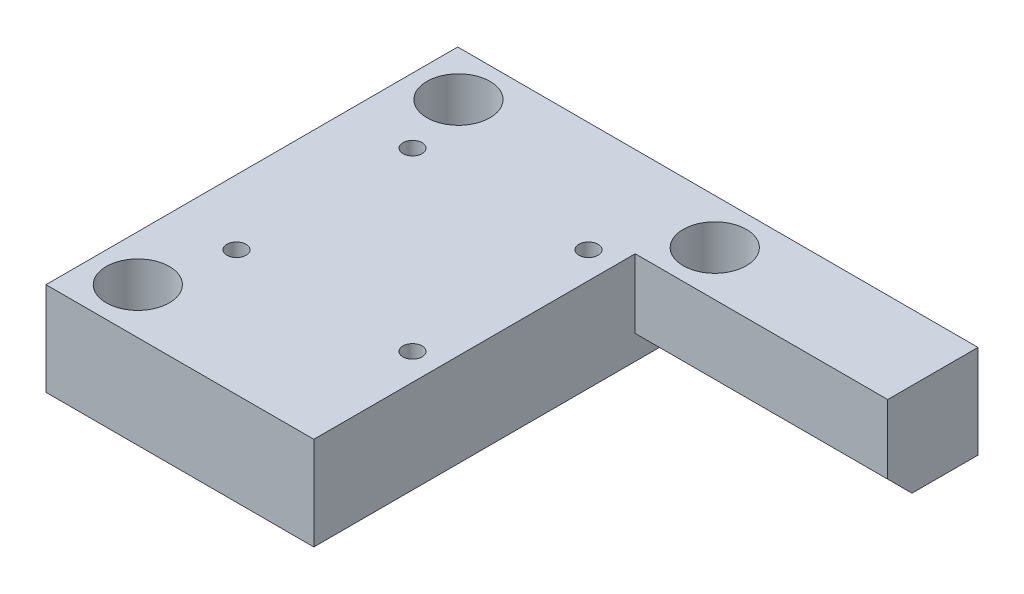
ISO-10303-21;
HEADER;
FILE_DESCRIPTION(('STEP AP214'),'2;1');
FILE_NAME('part.step','',(''),(''),'','','');
FILE_SCHEMA(('AUTOMOTIVE_DESIGN { 1 0 10303 214 1 1 1 1 }'));
ENDSEC;
DATA;
#1=APPLICATION_CONTEXT('core data for automotive mechanical design processes');
#2=APPLICATION_PROTOCOL_DEFINITION('international standard','automotive_design',2000,#1);
#3=PRODUCT_CONTEXT('',#1,'mechanical');
#4=PRODUCT('Part','Part','',(#3));
#5=PRODUCT_RELATED_PRODUCT_CATEGORY('part','',(#4));
#6=PRODUCT_DEFINITION_FORMATION('','',#4);
#7=PRODUCT_DEFINITION_CONTEXT('part definition',#1,'design');
#8=PRODUCT_DEFINITION('design','',#6,#7);
#9=PRODUCT_DEFINITION_SHAPE('','',#8);
#10=(LENGTH_UNIT() NAMED_UNIT(*) SI_UNIT(.MILLI.,.METRE.));
#11=(NAMED_UNIT(*) PLANE_ANGLE_UNIT() SI_UNIT($,.RADIAN.));
#12=(NAMED_UNIT(*) SI_UNIT($,.STERADIAN.) SOLID_ANGLE_UNIT());
#13=UNCERTAINTY_MEASURE_WITH_UNIT(LENGTH_MEASURE(1.E-05),#10,'distance_accuracy_value','');
#14=(GEOMETRIC_REPRESENTATION_CONTEXT(3) GLOBAL_UNCERTAINTY_ASSIGNED_CONTEXT((#13)) GLOBAL_UNIT_ASSIGNED_CONTEXT((#10,
#11,#12)) REPRESENTATION_CONTEXT('',''));
#15=CARTESIAN_POINT('',(0.,0.,0.));
#16=DIRECTION('',(0.,0.,1.));
#17=DIRECTION('',(1.,0.,0.));
#18=AXIS2_PLACEMENT_3D('',#15,#16,#17);
#19=CARTESIAN_POINT('',(6.,-12.19205,47.8));
#20=DIRECTION('',(0.,1.,0.));
#21=DIRECTION('',(0.,0.,1.));
#22=AXIS2_PLACEMENT_3D('',#19,#20,#21);
#23=CYLINDRICAL_SURFACE('',#22,2.25000000000001);
#24=CARTESIAN_POINT('',(6.,-12.192,47.8));
#25=DIRECTION('',(0.,1.,0.));
#26=DIRECTION('',(0.,0.,1.));
#27=AXIS2_PLACEMENT_3D('',#24,#25,#26);
#28=CIRCLE('',#27,2.25000000000001);
#29=CARTESIAN_POINT('',(6.,-12.192,50.05));
#30=VERTEX_POINT('',#29);
#31=EDGE_CURVE('E121',#30,#30,#28,.T.);
#32=ORIENTED_EDGE('',*,*,#31,.F.);
#33=EDGE_LOOP('',(#32));
#34=FACE_BOUND('',#33,.T.);
#35=CARTESIAN_POINT('',(6.,-7.,47.8));
#36=DIRECTION('',(0.,1.,0.));
#37=DIRECTION('',(0.,0.,1.));
#38=AXIS2_PLACEMENT_3D('',#35,#36,#37);
#39=CIRCLE('',#38,2.25000000000001);
#40=CARTESIAN_POINT('',(6.,-7.,50.05));
#41=VERTEX_POINT('',#40);
#42=EDGE_CURVE('E135',#41,#41,#39,.F.);
#43=ORIENTED_EDGE('',*,*,#42,.F.);
#44=EDGE_LOOP('',(#43));
#45=FACE_BOUND('',#44,.T.);
#46=ADVANCED_FACE('F37',(#34,#45),#23,.F.);
#47=CARTESIAN_POINT('',(6.,-12.192,5.90000000000001));
#48=DIRECTION('',(0.,1.,0.));
#49=DIRECTION('',(0.,0.,1.));
#50=AXIS2_PLACEMENT_3D('',#47,#48,#49);
#51=CYLINDRICAL_SURFACE('',#50,2.25);
#52=CARTESIAN_POINT('',(6.,-12.192,5.90000000000001));
#53=DIRECTION('',(0.,1.,0.));
#54=DIRECTION('',(0.,0.,1.));
#55=AXIS2_PLACEMENT_3D('',#52,#53,#54);
#56=CIRCLE('',#55,2.25);
#57=CARTESIAN_POINT('',(6.,-12.192,8.15000000000001));
#58=VERTEX_POINT('',#57);
#59=EDGE_CURVE('E186',#58,#58,#56,.T.);
#60=ORIENTED_EDGE('',*,*,#59,.F.);
#61=EDGE_LOOP('',(#60));
#62=FACE_BOUND('',#61,.T.);
#63=CARTESIAN_POINT('',(6.,-7.,5.90000000000001));
#64=DIRECTION('',(0.,1.,0.));
#65=DIRECTION('',(0.,0.,1.));
#66=AXIS2_PLACEMENT_3D('',#63,#64,#65);
#67=CIRCLE('',#66,2.25);
#68=CARTESIAN_POINT('',(6.,-7.,8.15000000000001));
#69=VERTEX_POINT('',#68);
#70=EDGE_CURVE('E167',#69,#69,#67,.F.);
#71=ORIENTED_EDGE('',*,*,#70,.F.);
#72=EDGE_LOOP('',(#71));
#73=FACE_BOUND('',#72,.T.);
#74=ADVANCED_FACE('F206',(#62,#73),#51,.F.);
#75=CARTESIAN_POINT('',(39.5,-12.192,5.9));
#76=DIRECTION('',(0.,1.,0.));
#77=DIRECTION('',(0.,0.,1.));
#78=AXIS2_PLACEMENT_3D('',#75,#76,#77);
#79=CYLINDRICAL_SURFACE('',#78,2.24999999999999);
#80=CARTESIAN_POINT('',(39.5,-12.192,5.9));
#81=DIRECTION('',(0.,1.,0.));
#82=DIRECTION('',(0.,0.,1.));
#83=AXIS2_PLACEMENT_3D('',#80,#81,#82);
#84=CIRCLE('',#83,2.24999999999999);
#85=CARTESIAN_POINT('',(39.5,-12.192,8.14999999999999));
#86=VERTEX_POINT('',#85);
#87=EDGE_CURVE('E175',#86,#86,#84,.T.);
#88=ORIENTED_EDGE('',*,*,#87,.F.);
#89=EDGE_LOOP('',(#88));
#90=FACE_BOUND('',#89,.T.);
#91=CARTESIAN_POINT('',(39.5,-7.,5.9));
#92=DIRECTION('',(0.,1.,0.));
#93=DIRECTION('',(0.,0.,1.));
#94=AXIS2_PLACEMENT_3D('',#91,#92,#93);
#95=CIRCLE('',#94,2.24999999999999);
#96=CARTESIAN_POINT('',(39.5,-7.,8.14999999999999));
#97=VERTEX_POINT('',#96);
#98=EDGE_CURVE('E184',#97,#97,#95,.F.);
#99=ORIENTED_EDGE('',*,*,#98,.F.);
#100=EDGE_LOOP('',(#99));
#101=FACE_BOUND('',#100,.T.);
#102=ADVANCED_FACE('F203',(#90,#101),#79,.F.);
#103=CARTESIAN_POINT('',(0.,0.,11.8));
#104=DIRECTION('',(1.,0.,0.));
#105=DIRECTION('',(0.,1.,0.));
#106=AXIS2_PLACEMENT_3D('',#103,#104,#105);
#107=PLANE('',#106);
#108=DIRECTION('',(0.,-1.,0.));
#109=VECTOR('',#108,1.);
#110=CARTESIAN_POINT('',(0.,0.,0.));
#111=LINE('',#110,#109);
#112=CARTESIAN_POINT('',(0.,0.,0.));
#113=VERTEX_POINT('',#112);
#114=CARTESIAN_POINT('',(0.,-12.192,0.));
#115=VERTEX_POINT('',#114);
#116=EDGE_CURVE('E104',#113,#115,#111,.T.);
#117=ORIENTED_EDGE('',*,*,#116,.T.);
#118=DIRECTION('',(0.,0.,-1.));
#119=VECTOR('',#118,1.);
#120=CARTESIAN_POINT('',(0.,-12.192,11.8));
#121=LINE('',#120,#119);
#122=CARTESIAN_POINT('',(0.,-12.192,53.8));
#123=VERTEX_POINT('',#122);
#124=EDGE_CURVE('E97',#123,#115,#121,.T.);
#125=ORIENTED_EDGE('',*,*,#124,.F.);
#126=DIRECTION('',(0.,-1.,0.));
#127=VECTOR('',#126,1.);
#128=CARTESIAN_POINT('',(0.,0.,53.8));
#129=LINE('',#128,#127);
#130=CARTESIAN_POINT('',(0.,0.,53.8));
#131=VERTEX_POINT('',#130);
#132=EDGE_CURVE('E102',#131,#123,#129,.T.);
#133=ORIENTED_EDGE('',*,*,#132,.F.);
#134=DIRECTION('',(0.,0.,-1.));
#135=VECTOR('',#134,1.);
#136=CARTESIAN_POINT('',(0.,0.,11.8));
#137=LINE('',#136,#135);
#138=EDGE_CURVE('E156',#131,#113,#137,.T.);
#139=ORIENTED_EDGE('',*,*,#138,.T.);
#140=EDGE_LOOP('',(#117,#125,#133,#139));
#141=FACE_BOUND('',#140,.T.);
#142=ADVANCED_FACE('F99',(#141),#107,.F.);
#143=CARTESIAN_POINT('',(0.,-12.192,11.8));
#144=DIRECTION('',(0.,1.,0.));
#145=DIRECTION('',(0.,0.,1.));
#146=AXIS2_PLACEMENT_3D('',#143,#144,#145);
#147=PLANE('',#146);
#148=CARTESIAN_POINT('',(31.5021834883644,-12.192,14.402424999977));
#149=DIRECTION('',(0.,1.,0.));
#150=DIRECTION('',(0.,0.,1.));
#151=AXIS2_PLACEMENT_3D('',#148,#149,#150);
#152=CIRCLE('',#151,1.2499999999937);
#153=CARTESIAN_POINT('',(31.5021834883644,-12.192,15.6524249999707));
#154=VERTEX_POINT('',#153);
#155=EDGE_CURVE('E271',#154,#154,#152,.F.);
#156=ORIENTED_EDGE('',*,*,#155,.F.);
#157=EDGE_LOOP('',(#156));
#158=FACE_BOUND('',#157,.T.);
#159=CARTESIAN_POINT('',(31.5000000000003,-12.192,37.4046084883411));
#160=DIRECTION('',(0.,1.,0.));
#161=DIRECTION('',(0.,0.,1.));
#162=AXIS2_PLACEMENT_3D('',#159,#160,#161);
#163=CIRCLE('',#162,1.24999999999371);
#164=CARTESIAN_POINT('',(31.5000000000003,-12.192,38.6546084883348));
#165=VERTEX_POINT('',#164);
#166=EDGE_CURVE('E275',#165,#165,#163,.F.);
#167=ORIENTED_EDGE('',*,*,#166,.F.);
#168=EDGE_LOOP('',(#167));
#169=FACE_BOUND('',#168,.T.);
#170=CARTESIAN_POINT('',(8.497816511636,-12.192,37.4024249999771));
#171=DIRECTION('',(0.,1.,0.));
#172=DIRECTION('',(0.,0.,1.));
#173=AXIS2_PLACEMENT_3D('',#170,#171,#172);
#174=CIRCLE('',#173,1.2499999999937);
#175=CARTESIAN_POINT('',(8.497816511636,-12.192,38.6524249999708));
#176=VERTEX_POINT('',#175);
#177=EDGE_CURVE('E279',#176,#176,#174,.F.);
#178=ORIENTED_EDGE('',*,*,#177,.F.);
#179=EDGE_LOOP('',(#178));
#180=FACE_BOUND('',#179,.T.);
#181=CARTESIAN_POINT('',(8.50000000000008,-12.192,14.4002415116128));
#182=DIRECTION('',(0.,1.,0.));
#183=DIRECTION('',(0.,0.,1.));
#184=AXIS2_PLACEMENT_3D('',#181,#182,#183);
#185=CIRCLE('',#184,1.24999999999369);
#186=CARTESIAN_POINT('',(8.50000000000008,-12.192,15.6502415116065));
#187=VERTEX_POINT('',#186);
#188=EDGE_CURVE('E283',#187,#187,#185,.F.);
#189=ORIENTED_EDGE('',*,*,#188,.F.);
#190=EDGE_LOOP('',(#189));
#191=FACE_BOUND('',#190,.T.);
#192=ORIENTED_EDGE('',*,*,#31,.T.);
#193=EDGE_LOOP('',(#192));
#194=FACE_BOUND('',#193,.T.);
#195=ORIENTED_EDGE('',*,*,#59,.T.);
#196=EDGE_LOOP('',(#195));
#197=FACE_BOUND('',#196,.T.);
#198=ORIENTED_EDGE('',*,*,#87,.T.);
#199=EDGE_LOOP('',(#198));
#200=FACE_BOUND('',#199,.T.);
#201=DIRECTION('',(0.,0.,-1.));
#202=VECTOR('',#201,1.);
#203=CARTESIAN_POINT('',(68.,-12.192,11.8));
#204=LINE('',#203,#202);
#205=CARTESIAN_POINT('',(68.,-12.192,8.62499999999999));
#206=VERTEX_POINT('',#205);
#207=CARTESIAN_POINT('',(68.,-12.192,0.));
#208=VERTEX_POINT('',#207);
#209=EDGE_CURVE('E108',#206,#208,#204,.T.);
#210=ORIENTED_EDGE('',*,*,#209,.F.);
#211=DIRECTION('',(-1.,0.,0.));
#212=VECTOR('',#211,1.);
#213=CARTESIAN_POINT('',(35.,-12.192,8.62499999999999));
#214=LINE('',#213,#212);
#215=CARTESIAN_POINT('',(35.,-12.192,8.62500000000001));
#216=VERTEX_POINT('',#215);
#217=EDGE_CURVE('E45',#206,#216,#214,.T.);
#218=ORIENTED_EDGE('',*,*,#217,.T.);
#219=DIRECTION('',(0.,0.,-1.));
#220=VECTOR('',#219,1.);
#221=CARTESIAN_POINT('',(35.,-12.192,53.8));
#222=LINE('',#221,#220);
#223=CARTESIAN_POINT('',(35.,-12.192,53.8));
#224=VERTEX_POINT('',#223);
#225=EDGE_CURVE('E51',#224,#216,#222,.T.);
#226=ORIENTED_EDGE('',*,*,#225,.F.);
#227=DIRECTION('',(1.,0.,0.));
#228=VECTOR('',#227,1.);
#229=CARTESIAN_POINT('',(0.,-12.192,53.8));
#230=LINE('',#229,#228);
#231=EDGE_CURVE('E110',#123,#224,#230,.T.);
#232=ORIENTED_EDGE('',*,*,#231,.F.);
#233=ORIENTED_EDGE('',*,*,#124,.T.);
#234=DIRECTION('',(1.,0.,0.));
#235=VECTOR('',#234,1.);
#236=CARTESIAN_POINT('',(0.,-12.192,0.));
#237=LINE('',#236,#235);
#238=EDGE_CURVE('E174',#115,#208,#237,.T.);
#239=ORIENTED_EDGE('',*,*,#238,.T.);
#240=EDGE_LOOP('',(#210,#218,#226,#232,#233,#239));
#241=FACE_BOUND('',#240,.T.);
#242=ADVANCED_FACE('F111',(#158,#169,#180,#191,#194,#197,#200,#241),#147,.F.);
#243=CARTESIAN_POINT('',(68.,0.,11.8));
#244=DIRECTION('',(-1.,0.,0.));
#245=DIRECTION('',(0.,0.,1.));
#246=AXIS2_PLACEMENT_3D('',#243,#244,#245);
#247=PLANE('',#246);
#248=DIRECTION('',(0.,1.,0.));
#249=VECTOR('',#248,1.);
#250=CARTESIAN_POINT('',(68.,0.,11.8));
#251=LINE('',#250,#249);
#252=CARTESIAN_POINT('',(68.,-9.017,11.8));
#253=VERTEX_POINT('',#252);
#254=CARTESIAN_POINT('',(68.,0.,11.8));
#255=VERTEX_POINT('',#254);
#256=EDGE_CURVE('E152',#253,#255,#251,.T.);
#257=ORIENTED_EDGE('',*,*,#256,.F.);
#258=DIRECTION('',(0.,-0.707106781186546,-0.707106781186549));
#259=VECTOR('',#258,1.);
#260=CARTESIAN_POINT('',(68.,-9.017,11.8));
#261=LINE('',#260,#259);
#262=EDGE_CURVE('E59',#253,#206,#261,.T.);
#263=ORIENTED_EDGE('',*,*,#262,.T.);
#264=ORIENTED_EDGE('',*,*,#209,.T.);
#265=DIRECTION('',(0.,1.,0.));
#266=VECTOR('',#265,1.);
#267=CARTESIAN_POINT('',(68.,0.,0.));
#268=LINE('',#267,#266);
#269=CARTESIAN_POINT('',(68.,0.,0.));
#270=VERTEX_POINT('',#269);
#271=EDGE_CURVE('E177',#208,#270,#268,.T.);
#272=ORIENTED_EDGE('',*,*,#271,.T.);
#273=DIRECTION('',(0.,0.,-1.));
#274=VECTOR('',#273,1.);
#275=CARTESIAN_POINT('',(68.,0.,11.8));
#276=LINE('',#275,#274);
#277=EDGE_CURVE('E182',#255,#270,#276,.T.);
#278=ORIENTED_EDGE('',*,*,#277,.F.);
#279=EDGE_LOOP('',(#257,#263,#264,#272,#278));
#280=FACE_BOUND('',#279,.T.);
#281=ADVANCED_FACE('F252',(#280),#247,.F.);
#282=CARTESIAN_POINT('',(0.,0.,11.8));
#283=DIRECTION('',(0.,-1.,0.));
#284=DIRECTION('',(0.,0.,-1.));
#285=AXIS2_PLACEMENT_3D('',#282,#283,#284);
#286=PLANE('',#285);
#287=CARTESIAN_POINT('',(31.5021834883644,0.,14.402424999977));
#288=DIRECTION('',(0.,1.,0.));
#289=DIRECTION('',(0.,0.,1.));
#290=AXIS2_PLACEMENT_3D('',#287,#288,#289);
#291=CIRCLE('',#290,1.2499999999937);
#292=CARTESIAN_POINT('',(31.5021834883644,0.,15.6524249999707));
#293=VERTEX_POINT('',#292);
#294=EDGE_CURVE('E321',#293,#293,#291,.T.);
#295=ORIENTED_EDGE('',*,*,#294,.F.);
#296=EDGE_LOOP('',(#295));
#297=FACE_BOUND('',#296,.T.);
#298=CARTESIAN_POINT('',(31.5000000000003,0.,37.4046084883411));
#299=DIRECTION('',(0.,1.,0.));
#300=DIRECTION('',(0.,0.,1.));
#301=AXIS2_PLACEMENT_3D('',#298,#299,#300);
#302=CIRCLE('',#301,1.24999999999371);
#303=CARTESIAN_POINT('',(31.5000000000003,0.,38.6546084883348));
#304=VERTEX_POINT('',#303);
#305=EDGE_CURVE('E317',#304,#304,#302,.T.);
#306=ORIENTED_EDGE('',*,*,#305,.F.);
#307=EDGE_LOOP('',(#306));
#308=FACE_BOUND('',#307,.T.);
#309=CARTESIAN_POINT('',(8.497816511636,0.,37.4024249999771));
#310=DIRECTION('',(0.,1.,0.));
#311=DIRECTION('',(0.,0.,1.));
#312=AXIS2_PLACEMENT_3D('',#309,#310,#311);
#313=CIRCLE('',#312,1.2499999999937);
#314=CARTESIAN_POINT('',(8.497816511636,0.,38.6524249999708));
#315=VERTEX_POINT('',#314);
#316=EDGE_CURVE('E313',#315,#315,#313,.T.);
#317=ORIENTED_EDGE('',*,*,#316,.F.);
#318=EDGE_LOOP('',(#317));
#319=FACE_BOUND('',#318,.T.);
#320=CARTESIAN_POINT('',(8.50000000000008,0.,14.4002415116128));
#321=DIRECTION('',(0.,1.,0.));
#322=DIRECTION('',(0.,0.,1.));
#323=AXIS2_PLACEMENT_3D('',#320,#321,#322);
#324=CIRCLE('',#323,1.24999999999369);
#325=CARTESIAN_POINT('',(8.50000000000008,0.,15.6502415116065));
#326=VERTEX_POINT('',#325);
#327=EDGE_CURVE('E309',#326,#326,#324,.T.);
#328=ORIENTED_EDGE('',*,*,#327,.F.);
#329=EDGE_LOOP('',(#328));
#330=FACE_BOUND('',#329,.T.);
#331=CARTESIAN_POINT('',(6.,0.,47.8));
#332=DIRECTION('',(0.,1.,0.));
#333=DIRECTION('',(0.,0.,1.));
#334=AXIS2_PLACEMENT_3D('',#331,#332,#333);
#335=CIRCLE('',#334,4.125);
#336=CARTESIAN_POINT('',(6.,0.,51.925));
#337=VERTEX_POINT('',#336);
#338=EDGE_CURVE('E302',#337,#337,#335,.T.);
#339=ORIENTED_EDGE('',*,*,#338,.F.);
#340=EDGE_LOOP('',(#339));
#341=FACE_BOUND('',#340,.T.);
#342=CARTESIAN_POINT('',(6.,0.,5.90000000000001));
#343=DIRECTION('',(0.,1.,0.));
#344=DIRECTION('',(0.,0.,1.));
#345=AXIS2_PLACEMENT_3D('',#342,#343,#344);
#346=CIRCLE('',#345,4.125);
#347=CARTESIAN_POINT('',(6.,0.,10.025));
#348=VERTEX_POINT('',#347);
#349=EDGE_CURVE('E160',#348,#348,#346,.T.);
#350=ORIENTED_EDGE('',*,*,#349,.F.);
#351=EDGE_LOOP('',(#350));
#352=FACE_BOUND('',#351,.T.);
#353=CARTESIAN_POINT('',(39.5,0.,5.9));
#354=DIRECTION('',(0.,1.,0.));
#355=DIRECTION('',(0.,0.,1.));
#356=AXIS2_PLACEMENT_3D('',#353,#354,#355);
#357=CIRCLE('',#356,4.125);
#358=CARTESIAN_POINT('',(39.5,0.,10.025));
#359=VERTEX_POINT('',#358);
#360=EDGE_CURVE('E193',#359,#359,#357,.T.);
#361=ORIENTED_EDGE('',*,*,#360,.F.);
#362=EDGE_LOOP('',(#361));
#363=FACE_BOUND('',#362,.T.);
#364=DIRECTION('',(-1.,0.,0.));
#365=VECTOR('',#364,1.);
#366=CARTESIAN_POINT('',(0.,0.,0.));
#367=LINE('',#366,#365);
#368=EDGE_CURVE('E179',#270,#113,#367,.T.);
#369=ORIENTED_EDGE('',*,*,#368,.T.);
#370=ORIENTED_EDGE('',*,*,#138,.F.);
#371=DIRECTION('',(-1.,0.,0.));
#372=VECTOR('',#371,1.);
#373=CARTESIAN_POINT('',(0.,0.,53.8));
#374=LINE('',#373,#372);
#375=CARTESIAN_POINT('',(35.,0.,53.8));
#376=VERTEX_POINT('',#375);
#377=EDGE_CURVE('E118',#376,#131,#374,.T.);
#378=ORIENTED_EDGE('',*,*,#377,.F.);
#379=DIRECTION('',(0.,0.,-1.));
#380=VECTOR('',#379,1.);
#381=CARTESIAN_POINT('',(35.,0.,53.8));
#382=LINE('',#381,#380);
#383=CARTESIAN_POINT('',(35.,0.,11.8));
#384=VERTEX_POINT('',#383);
#385=EDGE_CURVE('E128',#376,#384,#382,.T.);
#386=ORIENTED_EDGE('',*,*,#385,.T.);
#387=DIRECTION('',(-1.,0.,0.));
#388=VECTOR('',#387,1.);
#389=CARTESIAN_POINT('',(0.,0.,11.8));
#390=LINE('',#389,#388);
#391=EDGE_CURVE('E150',#255,#384,#390,.T.);
#392=ORIENTED_EDGE('',*,*,#391,.F.);
#393=ORIENTED_EDGE('',*,*,#277,.T.);
#394=EDGE_LOOP('',(#369,#370,#378,#386,#392,#393));
#395=FACE_BOUND('',#394,.T.);
#396=ADVANCED_FACE('F158',(#297,#308,#319,#330,#341,#352,#363,#395),#286,.F.);
#397=CARTESIAN_POINT('',(0.,0.,11.8));
#398=DIRECTION('',(0.,0.,1.));
#399=DIRECTION('',(1.,0.,0.));
#400=AXIS2_PLACEMENT_3D('',#397,#398,#399);
#401=PLANE('',#400);
#402=DIRECTION('',(0.,1.,0.));
#403=VECTOR('',#402,1.);
#404=CARTESIAN_POINT('',(35.,0.,11.8));
#405=LINE('',#404,#403);
#406=CARTESIAN_POINT('',(35.,-9.017,11.8));
#407=VERTEX_POINT('',#406);
#408=EDGE_CURVE('E119',#407,#384,#405,.T.);
#409=ORIENTED_EDGE('',*,*,#408,.F.);
#410=DIRECTION('',(1.,0.,0.));
#411=VECTOR('',#410,1.);
#412=CARTESIAN_POINT('',(68.,-9.017,11.8));
#413=LINE('',#412,#411);
#414=EDGE_CURVE('E107',#407,#253,#413,.T.);
#415=ORIENTED_EDGE('',*,*,#414,.T.);
#416=ORIENTED_EDGE('',*,*,#256,.T.);
#417=ORIENTED_EDGE('',*,*,#391,.T.);
#418=EDGE_LOOP('',(#409,#415,#416,#417));
#419=FACE_BOUND('',#418,.T.);
#420=ADVANCED_FACE('F148',(#419),#401,.T.);
#421=CARTESIAN_POINT('',(0.,0.,0.));
#422=DIRECTION('',(0.,0.,1.));
#423=DIRECTION('',(1.,0.,0.));
#424=AXIS2_PLACEMENT_3D('',#421,#422,#423);
#425=PLANE('',#424);
#426=ORIENTED_EDGE('',*,*,#116,.F.);
#427=ORIENTED_EDGE('',*,*,#368,.F.);
#428=ORIENTED_EDGE('',*,*,#271,.F.);
#429=ORIENTED_EDGE('',*,*,#238,.F.);
#430=EDGE_LOOP('',(#426,#427,#428,#429));
#431=FACE_BOUND('',#430,.T.);
#432=ADVANCED_FACE('F243',(#431),#425,.F.);
#433=CARTESIAN_POINT('',(39.5,-7.,5.9));
#434=DIRECTION('',(0.,1.,0.));
#435=DIRECTION('',(0.,0.,1.));
#436=AXIS2_PLACEMENT_3D('',#433,#434,#435);
#437=PLANE('',#436);
#438=CARTESIAN_POINT('',(39.5,-7.,5.9));
#439=DIRECTION('',(0.,1.,0.));
#440=DIRECTION('',(0.,0.,1.));
#441=AXIS2_PLACEMENT_3D('',#438,#439,#440);
#442=CIRCLE('',#441,4.125);
#443=CARTESIAN_POINT('',(39.5,-7.,10.025));
#444=VERTEX_POINT('',#443);
#445=EDGE_CURVE('E187',#444,#444,#442,.T.);
#446=ORIENTED_EDGE('',*,*,#445,.T.);
#447=EDGE_LOOP('',(#446));
#448=FACE_BOUND('',#447,.T.);
#449=ORIENTED_EDGE('',*,*,#98,.T.);
#450=EDGE_LOOP('',(#449));
#451=FACE_BOUND('',#450,.T.);
#452=ADVANCED_FACE('F240',(#448,#451),#437,.T.);
#453=CARTESIAN_POINT('',(39.5,-7.,5.9));
#454=DIRECTION('',(0.,1.,0.));
#455=DIRECTION('',(0.,0.,1.));
#456=AXIS2_PLACEMENT_3D('',#453,#454,#455);
#457=CYLINDRICAL_SURFACE('',#456,4.125);
#458=ORIENTED_EDGE('',*,*,#445,.F.);
#459=EDGE_LOOP('',(#458));
#460=FACE_BOUND('',#459,.T.);
#461=ORIENTED_EDGE('',*,*,#360,.T.);
#462=EDGE_LOOP('',(#461));
#463=FACE_BOUND('',#462,.T.);
#464=ADVANCED_FACE('F235',(#460,#463),#457,.F.);
#465=CARTESIAN_POINT('',(6.,-7.,5.90000000000001));
#466=DIRECTION('',(0.,1.,0.));
#467=DIRECTION('',(0.,0.,1.));
#468=AXIS2_PLACEMENT_3D('',#465,#466,#467);
#469=PLANE('',#468);
#470=CARTESIAN_POINT('',(6.,-7.,5.90000000000001));
#471=DIRECTION('',(0.,1.,0.));
#472=DIRECTION('',(0.,0.,1.));
#473=AXIS2_PLACEMENT_3D('',#470,#471,#472);
#474=CIRCLE('',#473,4.125);
#475=CARTESIAN_POINT('',(6.,-7.,10.025));
#476=VERTEX_POINT('',#475);
#477=EDGE_CURVE('E131',#476,#476,#474,.T.);
#478=ORIENTED_EDGE('',*,*,#477,.T.);
#479=EDGE_LOOP('',(#478));
#480=FACE_BOUND('',#479,.T.);
#481=ORIENTED_EDGE('',*,*,#70,.T.);
#482=EDGE_LOOP('',(#481));
#483=FACE_BOUND('',#482,.T.);
#484=ADVANCED_FACE('F232',(#480,#483),#469,.T.);
#485=CARTESIAN_POINT('',(6.,-7.,5.90000000000001));
#486=DIRECTION('',(0.,1.,0.));
#487=DIRECTION('',(0.,0.,1.));
#488=AXIS2_PLACEMENT_3D('',#485,#486,#487);
#489=CYLINDRICAL_SURFACE('',#488,4.125);
#490=ORIENTED_EDGE('',*,*,#477,.F.);
#491=EDGE_LOOP('',(#490));
#492=FACE_BOUND('',#491,.T.);
#493=ORIENTED_EDGE('',*,*,#349,.T.);
#494=EDGE_LOOP('',(#493));
#495=FACE_BOUND('',#494,.T.);
#496=ADVANCED_FACE('F231',(#492,#495),#489,.F.);
#497=CARTESIAN_POINT('',(35.,0.,53.8));
#498=DIRECTION('',(-1.,0.,0.));
#499=DIRECTION('',(0.,0.,1.));
#500=AXIS2_PLACEMENT_3D('',#497,#498,#499);
#501=PLANE('',#500);
#502=ORIENTED_EDGE('',*,*,#225,.T.);
#503=DIRECTION('',(0.,0.707106781186546,0.707106781186549));
#504=VECTOR('',#503,1.);
#505=CARTESIAN_POINT('',(35.,16.4915,37.3085000000001));
#506=LINE('',#505,#504);
#507=EDGE_CURVE('E11',#216,#407,#506,.T.);
#508=ORIENTED_EDGE('',*,*,#507,.T.);
#509=ORIENTED_EDGE('',*,*,#408,.T.);
#510=ORIENTED_EDGE('',*,*,#385,.F.);
#511=DIRECTION('',(0.,1.,0.));
#512=VECTOR('',#511,1.);
#513=CARTESIAN_POINT('',(35.,0.,53.8));
#514=LINE('',#513,#512);
#515=EDGE_CURVE('E113',#224,#376,#514,.T.);
#516=ORIENTED_EDGE('',*,*,#515,.F.);
#517=EDGE_LOOP('',(#502,#508,#509,#510,#516));
#518=FACE_BOUND('',#517,.T.);
#519=ADVANCED_FACE('F144',(#518),#501,.F.);
#520=CARTESIAN_POINT('',(0.,0.,53.8));
#521=DIRECTION('',(0.,0.,1.));
#522=DIRECTION('',(1.,0.,0.));
#523=AXIS2_PLACEMENT_3D('',#520,#521,#522);
#524=PLANE('',#523);
#525=ORIENTED_EDGE('',*,*,#132,.T.);
#526=ORIENTED_EDGE('',*,*,#231,.T.);
#527=ORIENTED_EDGE('',*,*,#515,.T.);
#528=ORIENTED_EDGE('',*,*,#377,.T.);
#529=EDGE_LOOP('',(#525,#526,#527,#528));
#530=FACE_BOUND('',#529,.T.);
#531=ADVANCED_FACE('F116',(#530),#524,.T.);
#532=CARTESIAN_POINT('',(6.,-7.,47.8));
#533=DIRECTION('',(0.,1.,0.));
#534=DIRECTION('',(0.,0.,1.));
#535=AXIS2_PLACEMENT_3D('',#532,#533,#534);
#536=PLANE('',#535);
#537=CARTESIAN_POINT('',(6.,-7.,47.8));
#538=DIRECTION('',(0.,1.,0.));
#539=DIRECTION('',(0.,0.,1.));
#540=AXIS2_PLACEMENT_3D('',#537,#538,#539);
#541=CIRCLE('',#540,4.125);
#542=CARTESIAN_POINT('',(6.,-7.,51.925));
#543=VERTEX_POINT('',#542);
#544=EDGE_CURVE('E298',#543,#543,#541,.T.);
#545=ORIENTED_EDGE('',*,*,#544,.T.);
#546=EDGE_LOOP('',(#545));
#547=FACE_BOUND('',#546,.T.);
#548=ORIENTED_EDGE('',*,*,#42,.T.);
#549=EDGE_LOOP('',(#548));
#550=FACE_BOUND('',#549,.T.);
#551=ADVANCED_FACE('F228',(#547,#550),#536,.T.);
#552=CARTESIAN_POINT('',(6.,-7.,47.8));
#553=DIRECTION('',(0.,1.,0.));
#554=DIRECTION('',(0.,0.,1.));
#555=AXIS2_PLACEMENT_3D('',#552,#553,#554);
#556=CYLINDRICAL_SURFACE('',#555,4.125);
#557=ORIENTED_EDGE('',*,*,#544,.F.);
#558=EDGE_LOOP('',(#557));
#559=FACE_BOUND('',#558,.T.);
#560=ORIENTED_EDGE('',*,*,#338,.T.);
#561=EDGE_LOOP('',(#560));
#562=FACE_BOUND('',#561,.T.);
#563=ADVANCED_FACE('F224',(#559,#562),#556,.F.);
#564=CARTESIAN_POINT('',(8.50000000000008,-12.19305,14.4002415116128));
#565=DIRECTION('',(0.,1.,0.));
#566=DIRECTION('',(0.,0.,1.));
#567=AXIS2_PLACEMENT_3D('',#564,#565,#566);
#568=CYLINDRICAL_SURFACE('',#567,1.24999999999369);
#569=ORIENTED_EDGE('',*,*,#327,.T.);
#570=EDGE_LOOP('',(#569));
#571=FACE_BOUND('',#570,.T.);
#572=ORIENTED_EDGE('',*,*,#188,.T.);
#573=EDGE_LOOP('',(#572));
#574=FACE_BOUND('',#573,.T.);
#575=ADVANCED_FACE('F339',(#571,#574),#568,.F.);
#576=CARTESIAN_POINT('',(8.497816511636,-12.19305,37.4024249999771));
#577=DIRECTION('',(0.,1.,0.));
#578=DIRECTION('',(0.,0.,1.));
#579=AXIS2_PLACEMENT_3D('',#576,#577,#578);
#580=CYLINDRICAL_SURFACE('',#579,1.2499999999937);
#581=ORIENTED_EDGE('',*,*,#316,.T.);
#582=EDGE_LOOP('',(#581));
#583=FACE_BOUND('',#582,.T.);
#584=ORIENTED_EDGE('',*,*,#177,.T.);
#585=EDGE_LOOP('',(#584));
#586=FACE_BOUND('',#585,.T.);
#587=ADVANCED_FACE('F333',(#583,#586),#580,.F.);
#588=CARTESIAN_POINT('',(31.5000000000003,-12.19305,37.4046084883411));
#589=DIRECTION('',(0.,1.,0.));
#590=DIRECTION('',(0.,0.,1.));
#591=AXIS2_PLACEMENT_3D('',#588,#589,#590);
#592=CYLINDRICAL_SURFACE('',#591,1.24999999999371);
#593=ORIENTED_EDGE('',*,*,#305,.T.);
#594=EDGE_LOOP('',(#593));
#595=FACE_BOUND('',#594,.T.);
#596=ORIENTED_EDGE('',*,*,#166,.T.);
#597=EDGE_LOOP('',(#596));
#598=FACE_BOUND('',#597,.T.);
#599=ADVANCED_FACE('F327',(#595,#598),#592,.F.);
#600=CARTESIAN_POINT('',(31.5021834883644,-12.19305,14.402424999977));
#601=DIRECTION('',(0.,1.,0.));
#602=DIRECTION('',(0.,0.,1.));
#603=AXIS2_PLACEMENT_3D('',#600,#601,#602);
#604=CYLINDRICAL_SURFACE('',#603,1.2499999999937);
#605=ORIENTED_EDGE('',*,*,#294,.T.);
#606=EDGE_LOOP('',(#605));
#607=FACE_BOUND('',#606,.T.);
#608=ORIENTED_EDGE('',*,*,#155,.T.);
#609=EDGE_LOOP('',(#608));
#610=FACE_BOUND('',#609,.T.);
#611=ADVANCED_FACE('F324',(#607,#610),#604,.F.);
#612=CARTESIAN_POINT('',(0.,-9.017,11.8));
#613=DIRECTION('',(0.,-0.707106781186549,0.707106781186546));
#614=DIRECTION('',(-1.,0.,0.));
#615=AXIS2_PLACEMENT_3D('',#612,#613,#614);
#616=PLANE('',#615);
#617=ORIENTED_EDGE('',*,*,#507,.F.);
#618=ORIENTED_EDGE('',*,*,#217,.F.);
#619=ORIENTED_EDGE('',*,*,#262,.F.);
#620=ORIENTED_EDGE('',*,*,#414,.F.);
#621=EDGE_LOOP('',(#617,#618,#619,#620));
#622=FACE_BOUND('',#621,.T.);
#623=ADVANCED_FACE('F39',(#622),#616,.T.);
#624=CLOSED_SHELL('',(#46,#74,#102,#142,#242,#281,#396,#420,#432,#452,#464,#484,#496,#519,#531,
#551,#563,#575,#587,#599,#611,#623));
#625=MANIFOLD_SOLID_BREP('B2',#624);
#626=ADVANCED_BREP_SHAPE_REPRESENTATION('',(#18,#625),#14);
#627=SHAPE_DEFINITION_REPRESENTATION(#9,#626);
ENDSEC;
END-ISO-10303-21;
